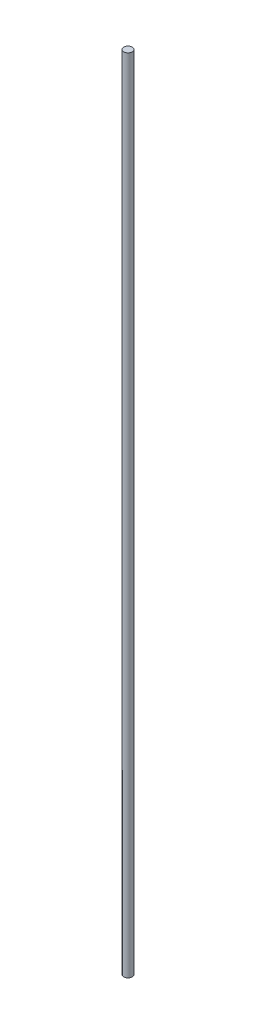
ISO-10303-21;
HEADER;
FILE_DESCRIPTION(('STEP AP214'),'2;1');
FILE_NAME('part.step','',(''),(''),'','','');
FILE_SCHEMA(('AUTOMOTIVE_DESIGN { 1 0 10303 214 1 1 1 1 }'));
ENDSEC;
DATA;
#1=APPLICATION_CONTEXT('core data for automotive mechanical design processes');
#2=APPLICATION_PROTOCOL_DEFINITION('international standard','automotive_design',2000,#1);
#3=PRODUCT_CONTEXT('',#1,'mechanical');
#4=PRODUCT('Part','Part','',(#3));
#5=PRODUCT_RELATED_PRODUCT_CATEGORY('part','',(#4));
#6=PRODUCT_DEFINITION_FORMATION('','',#4);
#7=PRODUCT_DEFINITION_CONTEXT('part definition',#1,'design');
#8=PRODUCT_DEFINITION('design','',#6,#7);
#9=PRODUCT_DEFINITION_SHAPE('','',#8);
#10=(LENGTH_UNIT() NAMED_UNIT(*) SI_UNIT(.MILLI.,.METRE.));
#11=(NAMED_UNIT(*) PLANE_ANGLE_UNIT() SI_UNIT($,.RADIAN.));
#12=(NAMED_UNIT(*) SI_UNIT($,.STERADIAN.) SOLID_ANGLE_UNIT());
#13=UNCERTAINTY_MEASURE_WITH_UNIT(LENGTH_MEASURE(1.E-05),#10,'distance_accuracy_value','');
#14=(GEOMETRIC_REPRESENTATION_CONTEXT(3) GLOBAL_UNCERTAINTY_ASSIGNED_CONTEXT((#13)) GLOBAL_UNIT_ASSIGNED_CONTEXT((#10,
#11,#12)) REPRESENTATION_CONTEXT('',''));
#15=CARTESIAN_POINT('',(0.,0.,0.));
#16=DIRECTION('',(0.,0.,1.));
#17=DIRECTION('',(1.,0.,0.));
#18=AXIS2_PLACEMENT_3D('',#15,#16,#17);
#19=CARTESIAN_POINT('',(0.,0.,0.));
#20=DIRECTION('',(0.,1.,0.));
#21=DIRECTION('',(0.,0.,1.));
#22=AXIS2_PLACEMENT_3D('',#19,#20,#21);
#23=PLANE('',#22);
#24=CARTESIAN_POINT('',(0.,0.,0.));
#25=DIRECTION('',(0.,1.,0.));
#26=DIRECTION('',(0.,0.,1.));
#27=AXIS2_PLACEMENT_3D('',#24,#25,#26);
#28=CIRCLE('',#27,0.5);
#29=CARTESIAN_POINT('',(0.,0.,0.5));
#30=VERTEX_POINT('',#29);
#31=EDGE_CURVE('E50',#30,#30,#28,.T.);
#32=ORIENTED_EDGE('',*,*,#31,.F.);
#33=EDGE_LOOP('',(#32));
#34=FACE_BOUND('',#33,.T.);
#35=ADVANCED_FACE('F43',(#34),#23,.F.);
#36=CARTESIAN_POINT('',(0.,95.,0.));
#37=DIRECTION('',(0.,1.,0.));
#38=DIRECTION('',(0.,0.,1.));
#39=AXIS2_PLACEMENT_3D('',#36,#37,#38);
#40=PLANE('',#39);
#41=CARTESIAN_POINT('',(0.,95.,0.));
#42=DIRECTION('',(0.,1.,0.));
#43=DIRECTION('',(0.,0.,1.));
#44=AXIS2_PLACEMENT_3D('',#41,#42,#43);
#45=CIRCLE('',#44,0.5);
#46=CARTESIAN_POINT('',(0.,95.,0.5));
#47=VERTEX_POINT('',#46);
#48=EDGE_CURVE('E10',#47,#47,#45,.T.);
#49=ORIENTED_EDGE('',*,*,#48,.T.);
#50=EDGE_LOOP('',(#49));
#51=FACE_BOUND('',#50,.T.);
#52=ADVANCED_FACE('F60',(#51),#40,.T.);
#53=CARTESIAN_POINT('',(0.,0.,0.));
#54=DIRECTION('',(0.,1.,0.));
#55=DIRECTION('',(0.,0.,1.));
#56=AXIS2_PLACEMENT_3D('',#53,#54,#55);
#57=CYLINDRICAL_SURFACE('',#56,0.5);
#58=ORIENTED_EDGE('',*,*,#48,.F.);
#59=EDGE_LOOP('',(#58));
#60=FACE_BOUND('',#59,.T.);
#61=ORIENTED_EDGE('',*,*,#31,.T.);
#62=EDGE_LOOP('',(#61));
#63=FACE_BOUND('',#62,.T.);
#64=ADVANCED_FACE('F57',(#60,#63),#57,.T.);
#65=CLOSED_SHELL('',(#35,#52,#64));
#66=MANIFOLD_SOLID_BREP('B2',#65);
#67=ADVANCED_BREP_SHAPE_REPRESENTATION('',(#18,#66),#14);
#68=SHAPE_DEFINITION_REPRESENTATION(#9,#67);
ENDSEC;
END-ISO-10303-21;
